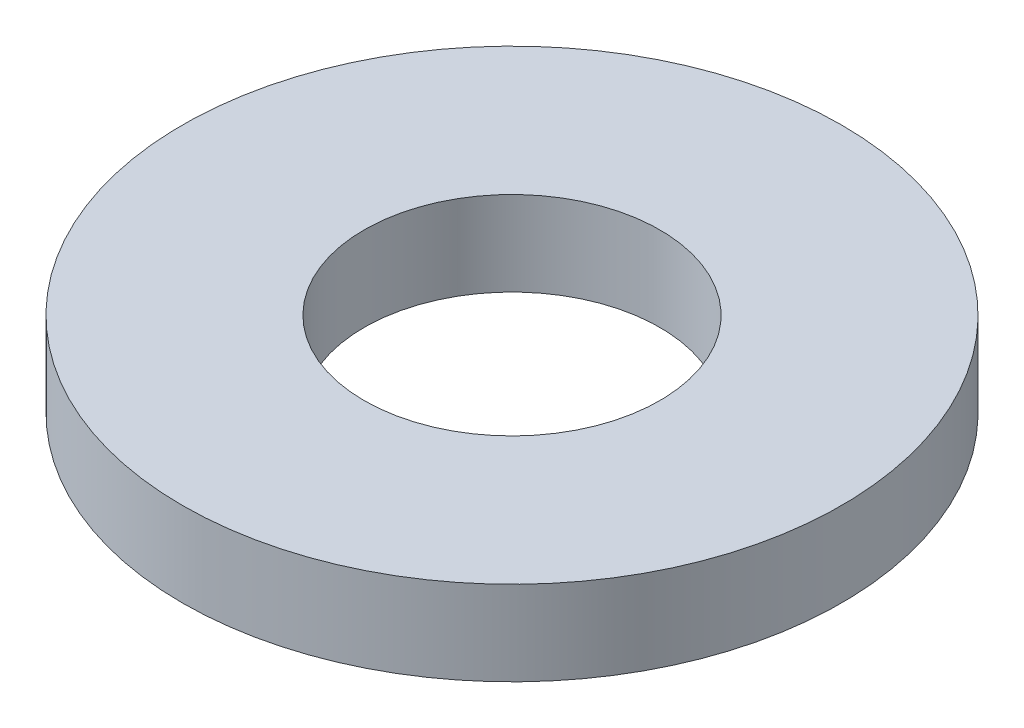
ISO-10303-21;
HEADER;
FILE_DESCRIPTION(('STEP AP214'),'2;1');
FILE_NAME('part.step','',(''),(''),'','','');
FILE_SCHEMA(('AUTOMOTIVE_DESIGN { 1 0 10303 214 1 1 1 1 }'));
ENDSEC;
DATA;
#1=APPLICATION_CONTEXT('core data for automotive mechanical design processes');
#2=APPLICATION_PROTOCOL_DEFINITION('international standard','automotive_design',2000,#1);
#3=PRODUCT_CONTEXT('',#1,'mechanical');
#4=PRODUCT('Part','Part','',(#3));
#5=PRODUCT_RELATED_PRODUCT_CATEGORY('part','',(#4));
#6=PRODUCT_DEFINITION_FORMATION('','',#4);
#7=PRODUCT_DEFINITION_CONTEXT('part definition',#1,'design');
#8=PRODUCT_DEFINITION('design','',#6,#7);
#9=PRODUCT_DEFINITION_SHAPE('','',#8);
#10=(LENGTH_UNIT() NAMED_UNIT(*) SI_UNIT(.MILLI.,.METRE.));
#11=(NAMED_UNIT(*) PLANE_ANGLE_UNIT() SI_UNIT($,.RADIAN.));
#12=(NAMED_UNIT(*) SI_UNIT($,.STERADIAN.) SOLID_ANGLE_UNIT());
#13=UNCERTAINTY_MEASURE_WITH_UNIT(LENGTH_MEASURE(1.E-05),#10,'distance_accuracy_value','');
#14=(GEOMETRIC_REPRESENTATION_CONTEXT(3) GLOBAL_UNCERTAINTY_ASSIGNED_CONTEXT((#13)) GLOBAL_UNIT_ASSIGNED_CONTEXT((#10,
#11,#12)) REPRESENTATION_CONTEXT('',''));
#15=CARTESIAN_POINT('',(0.,0.,0.));
#16=DIRECTION('',(0.,0.,1.));
#17=DIRECTION('',(1.,0.,0.));
#18=AXIS2_PLACEMENT_3D('',#15,#16,#17);
#19=CARTESIAN_POINT('',(0.,1.016,0.));
#20=DIRECTION('',(0.,-1.,0.));
#21=DIRECTION('',(0.,0.,-1.));
#22=AXIS2_PLACEMENT_3D('',#19,#20,#21);
#23=CYLINDRICAL_SURFACE('',#22,3.9624);
#24=CARTESIAN_POINT('',(0.,1.016,0.));
#25=DIRECTION('',(0.,1.,0.));
#26=DIRECTION('',(0.,0.,1.));
#27=AXIS2_PLACEMENT_3D('',#24,#25,#26);
#28=CIRCLE('',#27,3.9624);
#29=CARTESIAN_POINT('',(0.,1.016,3.9624));
#30=VERTEX_POINT('',#29);
#31=EDGE_CURVE('E10',#30,#30,#28,.T.);
#32=ORIENTED_EDGE('',*,*,#31,.F.);
#33=EDGE_LOOP('',(#32));
#34=FACE_BOUND('',#33,.T.);
#35=CARTESIAN_POINT('',(0.,0.,0.));
#36=DIRECTION('',(0.,1.,0.));
#37=DIRECTION('',(0.,0.,1.));
#38=AXIS2_PLACEMENT_3D('',#35,#36,#37);
#39=CIRCLE('',#38,3.9624);
#40=CARTESIAN_POINT('',(0.,0.,3.9624));
#41=VERTEX_POINT('',#40);
#42=EDGE_CURVE('E37',#41,#41,#39,.T.);
#43=ORIENTED_EDGE('',*,*,#42,.T.);
#44=EDGE_LOOP('',(#43));
#45=FACE_BOUND('',#44,.T.);
#46=ADVANCED_FACE('F34',(#34,#45),#23,.T.);
#47=CARTESIAN_POINT('',(0.,1.016,0.));
#48=DIRECTION('',(0.,1.,0.));
#49=DIRECTION('',(0.,0.,1.));
#50=AXIS2_PLACEMENT_3D('',#47,#48,#49);
#51=PLANE('',#50);
#52=CARTESIAN_POINT('',(0.,1.016,0.));
#53=DIRECTION('',(0.,1.,0.));
#54=DIRECTION('',(0.,0.,1.));
#55=AXIS2_PLACEMENT_3D('',#52,#53,#54);
#56=CIRCLE('',#55,1.778);
#57=CARTESIAN_POINT('',(0.,1.016,1.778));
#58=VERTEX_POINT('',#57);
#59=EDGE_CURVE('E46',#58,#58,#56,.T.);
#60=ORIENTED_EDGE('',*,*,#59,.F.);
#61=EDGE_LOOP('',(#60));
#62=FACE_BOUND('',#61,.T.);
#63=ORIENTED_EDGE('',*,*,#31,.T.);
#64=EDGE_LOOP('',(#63));
#65=FACE_BOUND('',#64,.T.);
#66=ADVANCED_FACE('F61',(#62,#65),#51,.T.);
#67=CARTESIAN_POINT('',(0.,0.,0.));
#68=DIRECTION('',(0.,1.,0.));
#69=DIRECTION('',(0.,0.,1.));
#70=AXIS2_PLACEMENT_3D('',#67,#68,#69);
#71=PLANE('',#70);
#72=CARTESIAN_POINT('',(0.,0.,0.));
#73=DIRECTION('',(0.,1.,0.));
#74=DIRECTION('',(0.,0.,1.));
#75=AXIS2_PLACEMENT_3D('',#72,#73,#74);
#76=CIRCLE('',#75,1.778);
#77=CARTESIAN_POINT('',(0.,0.,1.778));
#78=VERTEX_POINT('',#77);
#79=EDGE_CURVE('E44',#78,#78,#76,.T.);
#80=ORIENTED_EDGE('',*,*,#79,.T.);
#81=EDGE_LOOP('',(#80));
#82=FACE_BOUND('',#81,.T.);
#83=ORIENTED_EDGE('',*,*,#42,.F.);
#84=EDGE_LOOP('',(#83));
#85=FACE_BOUND('',#84,.T.);
#86=ADVANCED_FACE('F52',(#82,#85),#71,.F.);
#87=CARTESIAN_POINT('',(0.,0.,0.));
#88=DIRECTION('',(0.,1.,0.));
#89=DIRECTION('',(0.,0.,1.));
#90=AXIS2_PLACEMENT_3D('',#87,#88,#89);
#91=CYLINDRICAL_SURFACE('',#90,1.778);
#92=ORIENTED_EDGE('',*,*,#79,.F.);
#93=EDGE_LOOP('',(#92));
#94=FACE_BOUND('',#93,.T.);
#95=ORIENTED_EDGE('',*,*,#59,.T.);
#96=EDGE_LOOP('',(#95));
#97=FACE_BOUND('',#96,.T.);
#98=ADVANCED_FACE('F55',(#94,#97),#91,.F.);
#99=CLOSED_SHELL('',(#46,#66,#86,#98));
#100=MANIFOLD_SOLID_BREP('B2',#99);
#101=ADVANCED_BREP_SHAPE_REPRESENTATION('',(#18,#100),#14);
#102=SHAPE_DEFINITION_REPRESENTATION(#9,#101);
ENDSEC;
END-ISO-10303-21;
